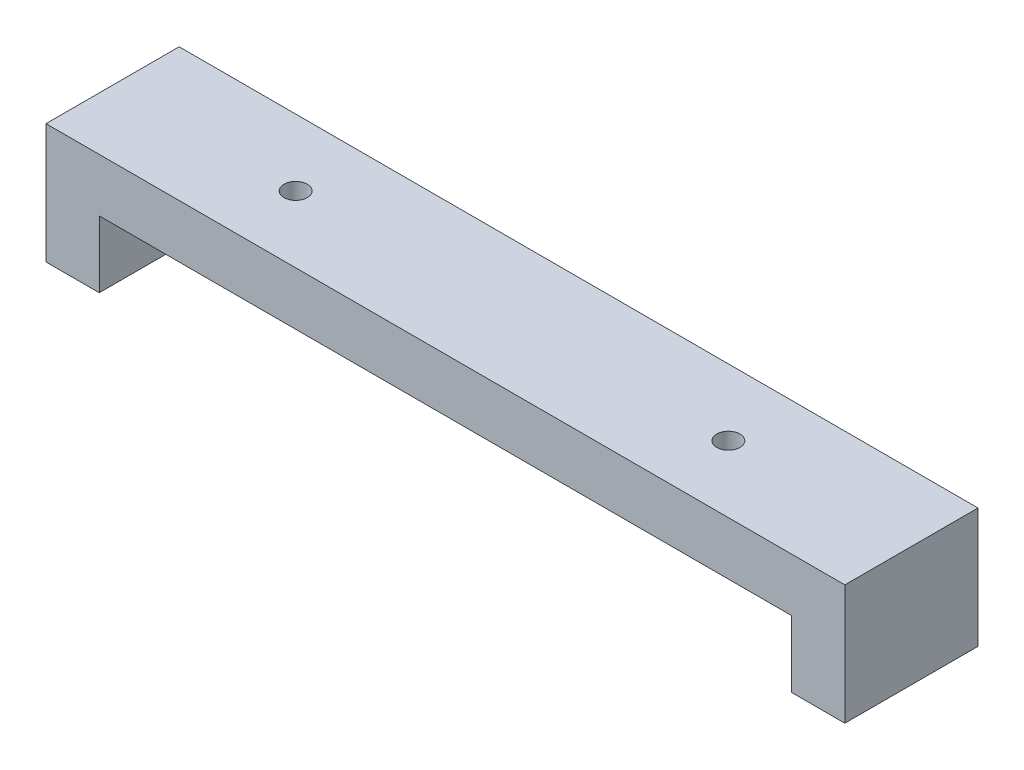
ISO-10303-21;
HEADER;
FILE_DESCRIPTION(('STEP AP214'),'2;1');
FILE_NAME('part.step','',(''),(''),'','','');
FILE_SCHEMA(('AUTOMOTIVE_DESIGN { 1 0 10303 214 1 1 1 1 }'));
ENDSEC;
DATA;
#1=APPLICATION_CONTEXT('core data for automotive mechanical design processes');
#2=APPLICATION_PROTOCOL_DEFINITION('international standard','automotive_design',2000,#1);
#3=PRODUCT_CONTEXT('',#1,'mechanical');
#4=PRODUCT('Part','Part','',(#3));
#5=PRODUCT_RELATED_PRODUCT_CATEGORY('part','',(#4));
#6=PRODUCT_DEFINITION_FORMATION('','',#4);
#7=PRODUCT_DEFINITION_CONTEXT('part definition',#1,'design');
#8=PRODUCT_DEFINITION('design','',#6,#7);
#9=PRODUCT_DEFINITION_SHAPE('','',#8);
#10=(LENGTH_UNIT() NAMED_UNIT(*) SI_UNIT(.MILLI.,.METRE.));
#11=(NAMED_UNIT(*) PLANE_ANGLE_UNIT() SI_UNIT($,.RADIAN.));
#12=(NAMED_UNIT(*) SI_UNIT($,.STERADIAN.) SOLID_ANGLE_UNIT());
#13=UNCERTAINTY_MEASURE_WITH_UNIT(LENGTH_MEASURE(1.E-05),#10,'distance_accuracy_value','');
#14=(GEOMETRIC_REPRESENTATION_CONTEXT(3) GLOBAL_UNCERTAINTY_ASSIGNED_CONTEXT((#13)) GLOBAL_UNIT_ASSIGNED_CONTEXT((#10,
#11,#12)) REPRESENTATION_CONTEXT('',''));
#15=CARTESIAN_POINT('',(0.,0.,0.));
#16=DIRECTION('',(0.,0.,1.));
#17=DIRECTION('',(1.,0.,0.));
#18=AXIS2_PLACEMENT_3D('',#15,#16,#17);
#19=CARTESIAN_POINT('',(0.,0.,0.));
#20=DIRECTION('',(0.,1.,0.));
#21=DIRECTION('',(0.,0.,1.));
#22=AXIS2_PLACEMENT_3D('',#19,#20,#21);
#23=PLANE('',#22);
#24=CARTESIAN_POINT('',(32.5,0.,0.));
#25=DIRECTION('',(0.,-1.,0.));
#26=DIRECTION('',(0.,0.,-1.));
#27=AXIS2_PLACEMENT_3D('',#24,#25,#26);
#28=CIRCLE('',#27,1.75);
#29=CARTESIAN_POINT('',(32.5,0.,-1.75));
#30=VERTEX_POINT('',#29);
#31=EDGE_CURVE('E198',#30,#30,#28,.T.);
#32=ORIENTED_EDGE('',*,*,#31,.F.);
#33=EDGE_LOOP('',(#32));
#34=FACE_BOUND('',#33,.T.);
#35=CARTESIAN_POINT('',(-32.5,0.,0.));
#36=DIRECTION('',(0.,-1.,0.));
#37=DIRECTION('',(0.,0.,-1.));
#38=AXIS2_PLACEMENT_3D('',#35,#36,#37);
#39=CIRCLE('',#38,1.75);
#40=CARTESIAN_POINT('',(-32.5,0.,-1.75));
#41=VERTEX_POINT('',#40);
#42=EDGE_CURVE('E137',#41,#41,#39,.T.);
#43=ORIENTED_EDGE('',*,*,#42,.F.);
#44=EDGE_LOOP('',(#43));
#45=FACE_BOUND('',#44,.T.);
#46=DIRECTION('',(0.,0.,1.));
#47=VECTOR('',#46,1.);
#48=CARTESIAN_POINT('',(-52.,0.,-10.));
#49=LINE('',#48,#47);
#50=CARTESIAN_POINT('',(-52.,0.,-10.));
#51=VERTEX_POINT('',#50);
#52=CARTESIAN_POINT('',(-52.,0.,10.));
#53=VERTEX_POINT('',#52);
#54=EDGE_CURVE('E132',#51,#53,#49,.T.);
#55=ORIENTED_EDGE('',*,*,#54,.F.);
#56=DIRECTION('',(-1.,0.,0.));
#57=VECTOR('',#56,1.);
#58=CARTESIAN_POINT('',(-60.,0.,-10.));
#59=LINE('',#58,#57);
#60=CARTESIAN_POINT('',(52.,0.,-10.));
#61=VERTEX_POINT('',#60);
#62=EDGE_CURVE('E174',#61,#51,#59,.T.);
#63=ORIENTED_EDGE('',*,*,#62,.F.);
#64=DIRECTION('',(0.,0.,-1.));
#65=VECTOR('',#64,1.);
#66=CARTESIAN_POINT('',(52.,0.,-10.));
#67=LINE('',#66,#65);
#68=CARTESIAN_POINT('',(52.,0.,10.));
#69=VERTEX_POINT('',#68);
#70=EDGE_CURVE('E148',#69,#61,#67,.T.);
#71=ORIENTED_EDGE('',*,*,#70,.F.);
#72=DIRECTION('',(1.,0.,0.));
#73=VECTOR('',#72,1.);
#74=CARTESIAN_POINT('',(-60.,0.,10.));
#75=LINE('',#74,#73);
#76=EDGE_CURVE('E62',#53,#69,#75,.T.);
#77=ORIENTED_EDGE('',*,*,#76,.F.);
#78=EDGE_LOOP('',(#55,#63,#71,#77));
#79=FACE_BOUND('',#78,.T.);
#80=ADVANCED_FACE('F39',(#34,#45,#79),#23,.F.);
#81=CARTESIAN_POINT('',(60.,8.,-10.));
#82=DIRECTION('',(-1.,0.,0.));
#83=DIRECTION('',(0.,0.,1.));
#84=AXIS2_PLACEMENT_3D('',#81,#82,#83);
#85=PLANE('',#84);
#86=DIRECTION('',(0.,-1.,0.));
#87=VECTOR('',#86,1.);
#88=CARTESIAN_POINT('',(60.,8.,10.));
#89=LINE('',#88,#87);
#90=CARTESIAN_POINT('',(60.,8.,10.));
#91=VERTEX_POINT('',#90);
#92=CARTESIAN_POINT('',(60.,-10.,10.));
#93=VERTEX_POINT('',#92);
#94=EDGE_CURVE('E187',#91,#93,#89,.T.);
#95=ORIENTED_EDGE('',*,*,#94,.T.);
#96=DIRECTION('',(0.,0.,1.));
#97=VECTOR('',#96,1.);
#98=CARTESIAN_POINT('',(60.,-10.,-10.));
#99=LINE('',#98,#97);
#100=CARTESIAN_POINT('',(60.,-10.,-10.));
#101=VERTEX_POINT('',#100);
#102=EDGE_CURVE('E149',#101,#93,#99,.T.);
#103=ORIENTED_EDGE('',*,*,#102,.F.);
#104=DIRECTION('',(0.,-1.,0.));
#105=VECTOR('',#104,1.);
#106=CARTESIAN_POINT('',(60.,8.,-10.));
#107=LINE('',#106,#105);
#108=CARTESIAN_POINT('',(60.,8.,-10.));
#109=VERTEX_POINT('',#108);
#110=EDGE_CURVE('E11',#109,#101,#107,.T.);
#111=ORIENTED_EDGE('',*,*,#110,.F.);
#112=DIRECTION('',(0.,0.,-1.));
#113=VECTOR('',#112,1.);
#114=CARTESIAN_POINT('',(60.,8.,-10.));
#115=LINE('',#114,#113);
#116=EDGE_CURVE('E175',#91,#109,#115,.T.);
#117=ORIENTED_EDGE('',*,*,#116,.F.);
#118=EDGE_LOOP('',(#95,#103,#111,#117));
#119=FACE_BOUND('',#118,.T.);
#120=ADVANCED_FACE('F41',(#119),#85,.F.);
#121=CARTESIAN_POINT('',(-60.,8.,-10.));
#122=DIRECTION('',(0.,0.,1.));
#123=DIRECTION('',(1.,0.,0.));
#124=AXIS2_PLACEMENT_3D('',#121,#122,#123);
#125=PLANE('',#124);
#126=ORIENTED_EDGE('',*,*,#110,.T.);
#127=DIRECTION('',(1.,0.,0.));
#128=VECTOR('',#127,1.);
#129=CARTESIAN_POINT('',(60.,-10.,-10.));
#130=LINE('',#129,#128);
#131=CARTESIAN_POINT('',(52.,-10.,-10.));
#132=VERTEX_POINT('',#131);
#133=EDGE_CURVE('E159',#132,#101,#130,.T.);
#134=ORIENTED_EDGE('',*,*,#133,.F.);
#135=DIRECTION('',(0.,1.,0.));
#136=VECTOR('',#135,1.);
#137=CARTESIAN_POINT('',(52.,-10.,-10.));
#138=LINE('',#137,#136);
#139=EDGE_CURVE('E163',#132,#61,#138,.T.);
#140=ORIENTED_EDGE('',*,*,#139,.T.);
#141=ORIENTED_EDGE('',*,*,#62,.T.);
#142=DIRECTION('',(0.,1.,0.));
#143=VECTOR('',#142,1.);
#144=CARTESIAN_POINT('',(-52.,-10.,-10.));
#145=LINE('',#144,#143);
#146=CARTESIAN_POINT('',(-52.,-10.,-10.));
#147=VERTEX_POINT('',#146);
#148=EDGE_CURVE('E122',#147,#51,#145,.T.);
#149=ORIENTED_EDGE('',*,*,#148,.F.);
#150=DIRECTION('',(1.,0.,0.));
#151=VECTOR('',#150,1.);
#152=CARTESIAN_POINT('',(-60.,-10.,-10.));
#153=LINE('',#152,#151);
#154=CARTESIAN_POINT('',(-60.,-10.,-10.));
#155=VERTEX_POINT('',#154);
#156=EDGE_CURVE('E119',#155,#147,#153,.T.);
#157=ORIENTED_EDGE('',*,*,#156,.F.);
#158=DIRECTION('',(0.,-1.,0.));
#159=VECTOR('',#158,1.);
#160=CARTESIAN_POINT('',(-60.,8.,-10.));
#161=LINE('',#160,#159);
#162=CARTESIAN_POINT('',(-60.,8.,-10.));
#163=VERTEX_POINT('',#162);
#164=EDGE_CURVE('E49',#163,#155,#161,.T.);
#165=ORIENTED_EDGE('',*,*,#164,.F.);
#166=DIRECTION('',(-1.,0.,0.));
#167=VECTOR('',#166,1.);
#168=CARTESIAN_POINT('',(-60.,8.,-10.));
#169=LINE('',#168,#167);
#170=EDGE_CURVE('E179',#109,#163,#169,.T.);
#171=ORIENTED_EDGE('',*,*,#170,.F.);
#172=EDGE_LOOP('',(#126,#134,#140,#141,#149,#157,#165,#171));
#173=FACE_BOUND('',#172,.T.);
#174=ADVANCED_FACE('F120',(#173),#125,.F.);
#175=CARTESIAN_POINT('',(-60.,8.,-10.));
#176=DIRECTION('',(1.,0.,0.));
#177=DIRECTION('',(0.,0.,-1.));
#178=AXIS2_PLACEMENT_3D('',#175,#176,#177);
#179=PLANE('',#178);
#180=ORIENTED_EDGE('',*,*,#164,.T.);
#181=DIRECTION('',(0.,0.,-1.));
#182=VECTOR('',#181,1.);
#183=CARTESIAN_POINT('',(-60.,-10.,-10.));
#184=LINE('',#183,#182);
#185=CARTESIAN_POINT('',(-60.,-10.,10.));
#186=VERTEX_POINT('',#185);
#187=EDGE_CURVE('E112',#186,#155,#184,.T.);
#188=ORIENTED_EDGE('',*,*,#187,.F.);
#189=DIRECTION('',(0.,-1.,0.));
#190=VECTOR('',#189,1.);
#191=CARTESIAN_POINT('',(-60.,8.,10.));
#192=LINE('',#191,#190);
#193=CARTESIAN_POINT('',(-60.,8.,10.));
#194=VERTEX_POINT('',#193);
#195=EDGE_CURVE('E116',#194,#186,#192,.T.);
#196=ORIENTED_EDGE('',*,*,#195,.F.);
#197=DIRECTION('',(0.,0.,1.));
#198=VECTOR('',#197,1.);
#199=CARTESIAN_POINT('',(-60.,8.,-10.));
#200=LINE('',#199,#198);
#201=EDGE_CURVE('E113',#163,#194,#200,.T.);
#202=ORIENTED_EDGE('',*,*,#201,.F.);
#203=EDGE_LOOP('',(#180,#188,#196,#202));
#204=FACE_BOUND('',#203,.T.);
#205=ADVANCED_FACE('F109',(#204),#179,.F.);
#206=CARTESIAN_POINT('',(-60.,8.,10.));
#207=DIRECTION('',(0.,0.,-1.));
#208=DIRECTION('',(-1.,0.,0.));
#209=AXIS2_PLACEMENT_3D('',#206,#207,#208);
#210=PLANE('',#209);
#211=ORIENTED_EDGE('',*,*,#195,.T.);
#212=DIRECTION('',(-1.,0.,0.));
#213=VECTOR('',#212,1.);
#214=CARTESIAN_POINT('',(-60.,-10.,10.));
#215=LINE('',#214,#213);
#216=CARTESIAN_POINT('',(-52.,-10.,10.));
#217=VERTEX_POINT('',#216);
#218=EDGE_CURVE('E130',#217,#186,#215,.T.);
#219=ORIENTED_EDGE('',*,*,#218,.F.);
#220=DIRECTION('',(0.,1.,0.));
#221=VECTOR('',#220,1.);
#222=CARTESIAN_POINT('',(-52.,-10.,10.));
#223=LINE('',#222,#221);
#224=EDGE_CURVE('E57',#217,#53,#223,.T.);
#225=ORIENTED_EDGE('',*,*,#224,.T.);
#226=ORIENTED_EDGE('',*,*,#76,.T.);
#227=DIRECTION('',(0.,1.,0.));
#228=VECTOR('',#227,1.);
#229=CARTESIAN_POINT('',(52.,-10.,10.));
#230=LINE('',#229,#228);
#231=CARTESIAN_POINT('',(52.,-10.,10.));
#232=VERTEX_POINT('',#231);
#233=EDGE_CURVE('E170',#232,#69,#230,.T.);
#234=ORIENTED_EDGE('',*,*,#233,.F.);
#235=DIRECTION('',(-1.,0.,0.));
#236=VECTOR('',#235,1.);
#237=CARTESIAN_POINT('',(60.,-10.,10.));
#238=LINE('',#237,#236);
#239=EDGE_CURVE('E153',#93,#232,#238,.T.);
#240=ORIENTED_EDGE('',*,*,#239,.F.);
#241=ORIENTED_EDGE('',*,*,#94,.F.);
#242=DIRECTION('',(1.,0.,0.));
#243=VECTOR('',#242,1.);
#244=CARTESIAN_POINT('',(-60.,8.,10.));
#245=LINE('',#244,#243);
#246=EDGE_CURVE('E184',#194,#91,#245,.T.);
#247=ORIENTED_EDGE('',*,*,#246,.F.);
#248=EDGE_LOOP('',(#211,#219,#225,#226,#234,#240,#241,#247));
#249=FACE_BOUND('',#248,.T.);
#250=ADVANCED_FACE('F225',(#249),#210,.F.);
#251=CARTESIAN_POINT('',(0.,8.,0.));
#252=DIRECTION('',(0.,1.,0.));
#253=DIRECTION('',(0.,0.,1.));
#254=AXIS2_PLACEMENT_3D('',#251,#252,#253);
#255=PLANE('',#254);
#256=CARTESIAN_POINT('',(32.5,8.,0.));
#257=DIRECTION('',(0.,1.,0.));
#258=DIRECTION('',(0.,0.,1.));
#259=AXIS2_PLACEMENT_3D('',#256,#257,#258);
#260=CIRCLE('',#259,1.75);
#261=CARTESIAN_POINT('',(32.5,8.,1.75));
#262=VERTEX_POINT('',#261);
#263=EDGE_CURVE('E43',#262,#262,#260,.T.);
#264=ORIENTED_EDGE('',*,*,#263,.F.);
#265=EDGE_LOOP('',(#264));
#266=FACE_BOUND('',#265,.T.);
#267=CARTESIAN_POINT('',(-32.5,8.,0.));
#268=DIRECTION('',(0.,1.,0.));
#269=DIRECTION('',(0.,0.,1.));
#270=AXIS2_PLACEMENT_3D('',#267,#268,#269);
#271=CIRCLE('',#270,1.75);
#272=CARTESIAN_POINT('',(-32.5,8.,1.75));
#273=VERTEX_POINT('',#272);
#274=EDGE_CURVE('E195',#273,#273,#271,.T.);
#275=ORIENTED_EDGE('',*,*,#274,.F.);
#276=EDGE_LOOP('',(#275));
#277=FACE_BOUND('',#276,.T.);
#278=ORIENTED_EDGE('',*,*,#116,.T.);
#279=ORIENTED_EDGE('',*,*,#170,.T.);
#280=ORIENTED_EDGE('',*,*,#201,.T.);
#281=ORIENTED_EDGE('',*,*,#246,.T.);
#282=EDGE_LOOP('',(#278,#279,#280,#281));
#283=FACE_BOUND('',#282,.T.);
#284=ADVANCED_FACE('F235',(#266,#277,#283),#255,.T.);
#285=CARTESIAN_POINT('',(52.,-10.,-10.));
#286=DIRECTION('',(1.,0.,0.));
#287=DIRECTION('',(0.,0.,-1.));
#288=AXIS2_PLACEMENT_3D('',#285,#286,#287);
#289=PLANE('',#288);
#290=ORIENTED_EDGE('',*,*,#70,.T.);
#291=ORIENTED_EDGE('',*,*,#139,.F.);
#292=DIRECTION('',(0.,0.,-1.));
#293=VECTOR('',#292,1.);
#294=CARTESIAN_POINT('',(52.,-10.,-10.));
#295=LINE('',#294,#293);
#296=EDGE_CURVE('E156',#232,#132,#295,.T.);
#297=ORIENTED_EDGE('',*,*,#296,.F.);
#298=ORIENTED_EDGE('',*,*,#233,.T.);
#299=EDGE_LOOP('',(#290,#291,#297,#298));
#300=FACE_BOUND('',#299,.T.);
#301=ADVANCED_FACE('F223',(#300),#289,.F.);
#302=CARTESIAN_POINT('',(0.,-10.,0.));
#303=DIRECTION('',(0.,-1.,0.));
#304=DIRECTION('',(0.,0.,-1.));
#305=AXIS2_PLACEMENT_3D('',#302,#303,#304);
#306=PLANE('',#305);
#307=ORIENTED_EDGE('',*,*,#102,.T.);
#308=ORIENTED_EDGE('',*,*,#239,.T.);
#309=ORIENTED_EDGE('',*,*,#296,.T.);
#310=ORIENTED_EDGE('',*,*,#133,.T.);
#311=EDGE_LOOP('',(#307,#308,#309,#310));
#312=FACE_BOUND('',#311,.T.);
#313=ADVANCED_FACE('F231',(#312),#306,.T.);
#314=CARTESIAN_POINT('',(-52.,-10.,-10.));
#315=DIRECTION('',(-1.,0.,0.));
#316=DIRECTION('',(0.,0.,1.));
#317=AXIS2_PLACEMENT_3D('',#314,#315,#316);
#318=PLANE('',#317);
#319=ORIENTED_EDGE('',*,*,#54,.T.);
#320=ORIENTED_EDGE('',*,*,#224,.F.);
#321=DIRECTION('',(0.,0.,1.));
#322=VECTOR('',#321,1.);
#323=CARTESIAN_POINT('',(-52.,-10.,-10.));
#324=LINE('',#323,#322);
#325=EDGE_CURVE('E126',#147,#217,#324,.T.);
#326=ORIENTED_EDGE('',*,*,#325,.F.);
#327=ORIENTED_EDGE('',*,*,#148,.T.);
#328=EDGE_LOOP('',(#319,#320,#326,#327));
#329=FACE_BOUND('',#328,.T.);
#330=ADVANCED_FACE('F294',(#329),#318,.F.);
#331=CARTESIAN_POINT('',(0.,-10.,0.));
#332=DIRECTION('',(0.,1.,0.));
#333=DIRECTION('',(0.,0.,1.));
#334=AXIS2_PLACEMENT_3D('',#331,#332,#333);
#335=PLANE('',#334);
#336=ORIENTED_EDGE('',*,*,#187,.T.);
#337=ORIENTED_EDGE('',*,*,#156,.T.);
#338=ORIENTED_EDGE('',*,*,#325,.T.);
#339=ORIENTED_EDGE('',*,*,#218,.T.);
#340=EDGE_LOOP('',(#336,#337,#338,#339));
#341=FACE_BOUND('',#340,.T.);
#342=ADVANCED_FACE('F129',(#341),#335,.F.);
#343=CARTESIAN_POINT('',(-32.5,10.,0.));
#344=DIRECTION('',(0.,-1.,0.));
#345=DIRECTION('',(0.,0.,-1.));
#346=AXIS2_PLACEMENT_3D('',#343,#344,#345);
#347=CYLINDRICAL_SURFACE('',#346,1.75);
#348=ORIENTED_EDGE('',*,*,#274,.T.);
#349=EDGE_LOOP('',(#348));
#350=FACE_BOUND('',#349,.T.);
#351=ORIENTED_EDGE('',*,*,#42,.T.);
#352=EDGE_LOOP('',(#351));
#353=FACE_BOUND('',#352,.T.);
#354=ADVANCED_FACE('F211',(#350,#353),#347,.F.);
#355=CARTESIAN_POINT('',(32.5,10.,0.));
#356=DIRECTION('',(0.,-1.,0.));
#357=DIRECTION('',(0.,0.,-1.));
#358=AXIS2_PLACEMENT_3D('',#355,#356,#357);
#359=CYLINDRICAL_SURFACE('',#358,1.75);
#360=ORIENTED_EDGE('',*,*,#263,.T.);
#361=EDGE_LOOP('',(#360));
#362=FACE_BOUND('',#361,.T.);
#363=ORIENTED_EDGE('',*,*,#31,.T.);
#364=EDGE_LOOP('',(#363));
#365=FACE_BOUND('',#364,.T.);
#366=ADVANCED_FACE('F279',(#362,#365),#359,.F.);
#367=CLOSED_SHELL('',(#80,#120,#174,#205,#250,#284,#301,#313,#330,#342,#354,#366));
#368=MANIFOLD_SOLID_BREP('B2',#367);
#369=ADVANCED_BREP_SHAPE_REPRESENTATION('',(#18,#368),#14);
#370=SHAPE_DEFINITION_REPRESENTATION(#9,#369);
ENDSEC;
END-ISO-10303-21;
